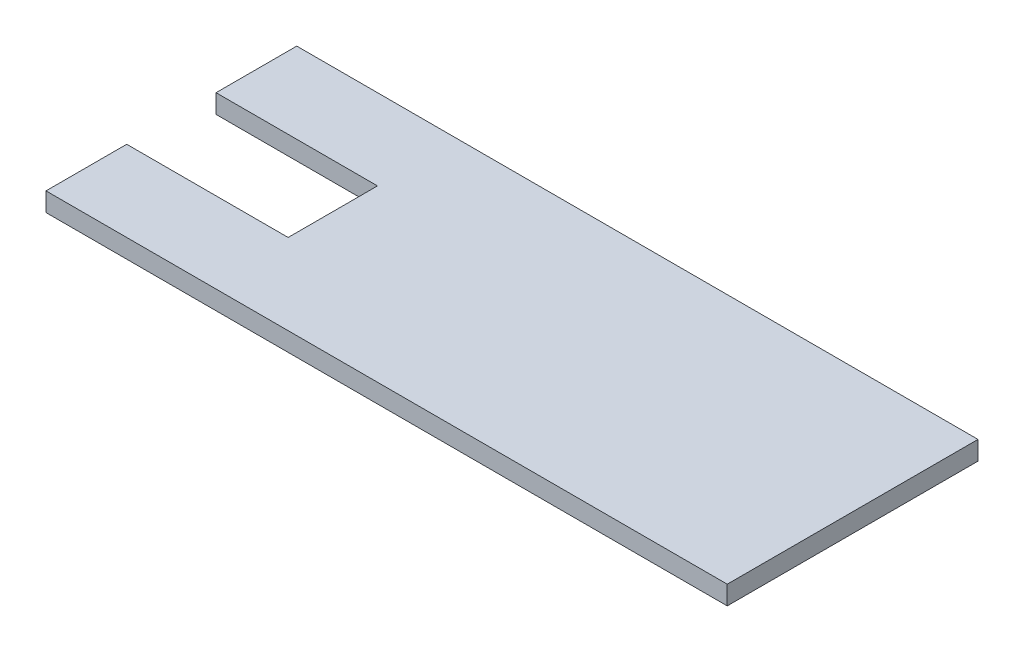
ISO-10303-21;
HEADER;
FILE_DESCRIPTION(('STEP AP214'),'2;1');
FILE_NAME('part.step','',(''),(''),'','','');
FILE_SCHEMA(('AUTOMOTIVE_DESIGN { 1 0 10303 214 1 1 1 1 }'));
ENDSEC;
DATA;
#1=APPLICATION_CONTEXT('core data for automotive mechanical design processes');
#2=APPLICATION_PROTOCOL_DEFINITION('international standard','automotive_design',2000,#1);
#3=PRODUCT_CONTEXT('',#1,'mechanical');
#4=PRODUCT('Part','Part','',(#3));
#5=PRODUCT_RELATED_PRODUCT_CATEGORY('part','',(#4));
#6=PRODUCT_DEFINITION_FORMATION('','',#4);
#7=PRODUCT_DEFINITION_CONTEXT('part definition',#1,'design');
#8=PRODUCT_DEFINITION('design','',#6,#7);
#9=PRODUCT_DEFINITION_SHAPE('','',#8);
#10=(LENGTH_UNIT() NAMED_UNIT(*) SI_UNIT(.MILLI.,.METRE.));
#11=(NAMED_UNIT(*) PLANE_ANGLE_UNIT() SI_UNIT($,.RADIAN.));
#12=(NAMED_UNIT(*) SI_UNIT($,.STERADIAN.) SOLID_ANGLE_UNIT());
#13=UNCERTAINTY_MEASURE_WITH_UNIT(LENGTH_MEASURE(1.E-05),#10,'distance_accuracy_value','');
#14=(GEOMETRIC_REPRESENTATION_CONTEXT(3) GLOBAL_UNCERTAINTY_ASSIGNED_CONTEXT((#13)) GLOBAL_UNIT_ASSIGNED_CONTEXT((#10,
#11,#12)) REPRESENTATION_CONTEXT('',''));
#15=CARTESIAN_POINT('',(0.,0.,0.));
#16=DIRECTION('',(0.,0.,1.));
#17=DIRECTION('',(1.,0.,0.));
#18=AXIS2_PLACEMENT_3D('',#15,#16,#17);
#19=CARTESIAN_POINT('',(-63.3,3.5,-23.3));
#20=DIRECTION('',(1.,0.,0.));
#21=DIRECTION('',(0.,0.,-1.));
#22=AXIS2_PLACEMENT_3D('',#19,#20,#21);
#23=PLANE('',#22);
#24=DIRECTION('',(0.,0.,1.));
#25=VECTOR('',#24,1.);
#26=CARTESIAN_POINT('',(-63.3,0.,-23.3));
#27=LINE('',#26,#25);
#28=CARTESIAN_POINT('',(-63.3,0.,-23.3));
#29=VERTEX_POINT('',#28);
#30=CARTESIAN_POINT('',(-63.3,0.,-8.29999999999999));
#31=VERTEX_POINT('',#30);
#32=EDGE_CURVE('E126',#29,#31,#27,.T.);
#33=ORIENTED_EDGE('',*,*,#32,.T.);
#34=DIRECTION('',(0.,1.,0.));
#35=VECTOR('',#34,1.);
#36=CARTESIAN_POINT('',(-63.3,0.,-8.29999999999999));
#37=LINE('',#36,#35);
#38=CARTESIAN_POINT('',(-63.3,3.5,-8.29999999999999));
#39=VERTEX_POINT('',#38);
#40=EDGE_CURVE('E127',#31,#39,#37,.T.);
#41=ORIENTED_EDGE('',*,*,#40,.T.);
#42=DIRECTION('',(0.,0.,1.));
#43=VECTOR('',#42,1.);
#44=CARTESIAN_POINT('',(-63.3,3.5,-23.3));
#45=LINE('',#44,#43);
#46=CARTESIAN_POINT('',(-63.3,3.5,-23.3));
#47=VERTEX_POINT('',#46);
#48=EDGE_CURVE('E156',#47,#39,#45,.T.);
#49=ORIENTED_EDGE('',*,*,#48,.F.);
#50=DIRECTION('',(0.,-1.,0.));
#51=VECTOR('',#50,1.);
#52=CARTESIAN_POINT('',(-63.3,3.5,-23.3));
#53=LINE('',#52,#51);
#54=EDGE_CURVE('E140',#47,#29,#53,.T.);
#55=ORIENTED_EDGE('',*,*,#54,.T.);
#56=EDGE_LOOP('',(#33,#41,#49,#55));
#57=FACE_BOUND('',#56,.T.);
#58=ADVANCED_FACE('F33',(#57),#23,.F.);
#59=CARTESIAN_POINT('',(-63.3,3.5,8.3));
#60=VERTEX_POINT('',#59);
#61=CARTESIAN_POINT('',(-63.3,3.5,23.3));
#62=VERTEX_POINT('',#61);
#63=EDGE_CURVE('E85',#60,#62,#45,.T.);
#64=ORIENTED_EDGE('',*,*,#63,.F.);
#65=DIRECTION('',(0.,1.,0.));
#66=VECTOR('',#65,1.);
#67=CARTESIAN_POINT('',(-63.3,0.,8.3));
#68=LINE('',#67,#66);
#69=CARTESIAN_POINT('',(-63.3,0.,8.3));
#70=VERTEX_POINT('',#69);
#71=EDGE_CURVE('E111',#70,#60,#68,.T.);
#72=ORIENTED_EDGE('',*,*,#71,.F.);
#73=CARTESIAN_POINT('',(-63.3,0.,23.3));
#74=VERTEX_POINT('',#73);
#75=EDGE_CURVE('E119',#70,#74,#27,.T.);
#76=ORIENTED_EDGE('',*,*,#75,.T.);
#77=DIRECTION('',(0.,-1.,0.));
#78=VECTOR('',#77,1.);
#79=CARTESIAN_POINT('',(-63.3,3.5,23.3));
#80=LINE('',#79,#78);
#81=EDGE_CURVE('E11',#62,#74,#80,.T.);
#82=ORIENTED_EDGE('',*,*,#81,.F.);
#83=EDGE_LOOP('',(#64,#72,#76,#82));
#84=FACE_BOUND('',#83,.T.);
#85=ADVANCED_FACE('F35',(#84),#23,.F.);
#86=CARTESIAN_POINT('',(-63.3,3.5,23.3));
#87=DIRECTION('',(0.,0.,-1.));
#88=DIRECTION('',(-1.,0.,0.));
#89=AXIS2_PLACEMENT_3D('',#86,#87,#88);
#90=PLANE('',#89);
#91=DIRECTION('',(1.,0.,0.));
#92=VECTOR('',#91,1.);
#93=CARTESIAN_POINT('',(-63.3,0.,23.3));
#94=LINE('',#93,#92);
#95=CARTESIAN_POINT('',(63.3,0.,23.3));
#96=VERTEX_POINT('',#95);
#97=EDGE_CURVE('E125',#74,#96,#94,.T.);
#98=ORIENTED_EDGE('',*,*,#97,.T.);
#99=DIRECTION('',(0.,-1.,0.));
#100=VECTOR('',#99,1.);
#101=CARTESIAN_POINT('',(63.3,3.5,23.3));
#102=LINE('',#101,#100);
#103=CARTESIAN_POINT('',(63.3,3.5,23.3));
#104=VERTEX_POINT('',#103);
#105=EDGE_CURVE('E41',#104,#96,#102,.T.);
#106=ORIENTED_EDGE('',*,*,#105,.F.);
#107=DIRECTION('',(1.,0.,0.));
#108=VECTOR('',#107,1.);
#109=CARTESIAN_POINT('',(-63.3,3.5,23.3));
#110=LINE('',#109,#108);
#111=EDGE_CURVE('E158',#62,#104,#110,.T.);
#112=ORIENTED_EDGE('',*,*,#111,.F.);
#113=ORIENTED_EDGE('',*,*,#81,.T.);
#114=EDGE_LOOP('',(#98,#106,#112,#113));
#115=FACE_BOUND('',#114,.T.);
#116=ADVANCED_FACE('F189',(#115),#90,.F.);
#117=CARTESIAN_POINT('',(63.3,3.5,-23.3));
#118=DIRECTION('',(-1.,0.,0.));
#119=DIRECTION('',(0.,0.,1.));
#120=AXIS2_PLACEMENT_3D('',#117,#118,#119);
#121=PLANE('',#120);
#122=DIRECTION('',(0.,0.,-1.));
#123=VECTOR('',#122,1.);
#124=CARTESIAN_POINT('',(63.3,0.,-23.3));
#125=LINE('',#124,#123);
#126=CARTESIAN_POINT('',(63.3,0.,-23.3));
#127=VERTEX_POINT('',#126);
#128=EDGE_CURVE('E137',#96,#127,#125,.T.);
#129=ORIENTED_EDGE('',*,*,#128,.T.);
#130=DIRECTION('',(0.,-1.,0.));
#131=VECTOR('',#130,1.);
#132=CARTESIAN_POINT('',(63.3,3.5,-23.3));
#133=LINE('',#132,#131);
#134=CARTESIAN_POINT('',(63.3,3.5,-23.3));
#135=VERTEX_POINT('',#134);
#136=EDGE_CURVE('E142',#135,#127,#133,.T.);
#137=ORIENTED_EDGE('',*,*,#136,.F.);
#138=DIRECTION('',(0.,0.,-1.));
#139=VECTOR('',#138,1.);
#140=CARTESIAN_POINT('',(63.3,3.5,-23.3));
#141=LINE('',#140,#139);
#142=EDGE_CURVE('E149',#104,#135,#141,.T.);
#143=ORIENTED_EDGE('',*,*,#142,.F.);
#144=ORIENTED_EDGE('',*,*,#105,.T.);
#145=EDGE_LOOP('',(#129,#137,#143,#144));
#146=FACE_BOUND('',#145,.T.);
#147=ADVANCED_FACE('F147',(#146),#121,.F.);
#148=CARTESIAN_POINT('',(-63.3,3.5,-23.3));
#149=DIRECTION('',(0.,0.,1.));
#150=DIRECTION('',(1.,0.,0.));
#151=AXIS2_PLACEMENT_3D('',#148,#149,#150);
#152=PLANE('',#151);
#153=DIRECTION('',(-1.,0.,0.));
#154=VECTOR('',#153,1.);
#155=CARTESIAN_POINT('',(-63.3,0.,-23.3));
#156=LINE('',#155,#154);
#157=EDGE_CURVE('E78',#127,#29,#156,.T.);
#158=ORIENTED_EDGE('',*,*,#157,.T.);
#159=ORIENTED_EDGE('',*,*,#54,.F.);
#160=DIRECTION('',(-1.,0.,0.));
#161=VECTOR('',#160,1.);
#162=CARTESIAN_POINT('',(-63.3,3.5,-23.3));
#163=LINE('',#162,#161);
#164=EDGE_CURVE('E57',#135,#47,#163,.T.);
#165=ORIENTED_EDGE('',*,*,#164,.F.);
#166=ORIENTED_EDGE('',*,*,#136,.T.);
#167=EDGE_LOOP('',(#158,#159,#165,#166));
#168=FACE_BOUND('',#167,.T.);
#169=ADVANCED_FACE('F157',(#168),#152,.F.);
#170=CARTESIAN_POINT('',(0.,3.5,0.));
#171=DIRECTION('',(0.,1.,0.));
#172=DIRECTION('',(0.,0.,1.));
#173=AXIS2_PLACEMENT_3D('',#170,#171,#172);
#174=PLANE('',#173);
#175=DIRECTION('',(-1.,0.,0.));
#176=VECTOR('',#175,1.);
#177=CARTESIAN_POINT('',(-63.3,3.5,-8.29999999999999));
#178=LINE('',#177,#176);
#179=CARTESIAN_POINT('',(-33.3,3.5,-8.29999999999999));
#180=VERTEX_POINT('',#179);
#181=EDGE_CURVE('E115',#180,#39,#178,.T.);
#182=ORIENTED_EDGE('',*,*,#181,.F.);
#183=DIRECTION('',(0.,0.,-1.));
#184=VECTOR('',#183,1.);
#185=CARTESIAN_POINT('',(-33.3,3.5,-8.29999999999999));
#186=LINE('',#185,#184);
#187=CARTESIAN_POINT('',(-33.3,3.5,8.3));
#188=VERTEX_POINT('',#187);
#189=EDGE_CURVE('E165',#188,#180,#186,.T.);
#190=ORIENTED_EDGE('',*,*,#189,.F.);
#191=DIRECTION('',(1.,0.,0.));
#192=VECTOR('',#191,1.);
#193=CARTESIAN_POINT('',(-63.3,3.5,8.3));
#194=LINE('',#193,#192);
#195=EDGE_CURVE('E168',#60,#188,#194,.T.);
#196=ORIENTED_EDGE('',*,*,#195,.F.);
#197=ORIENTED_EDGE('',*,*,#63,.T.);
#198=ORIENTED_EDGE('',*,*,#111,.T.);
#199=ORIENTED_EDGE('',*,*,#142,.T.);
#200=ORIENTED_EDGE('',*,*,#164,.T.);
#201=ORIENTED_EDGE('',*,*,#48,.T.);
#202=EDGE_LOOP('',(#182,#190,#196,#197,#198,#199,#200,#201));
#203=FACE_BOUND('',#202,.T.);
#204=ADVANCED_FACE('F173',(#203),#174,.T.);
#205=CARTESIAN_POINT('',(0.,0.,0.));
#206=DIRECTION('',(0.,1.,0.));
#207=DIRECTION('',(0.,0.,1.));
#208=AXIS2_PLACEMENT_3D('',#205,#206,#207);
#209=PLANE('',#208);
#210=DIRECTION('',(0.,0.,-1.));
#211=VECTOR('',#210,1.);
#212=CARTESIAN_POINT('',(-33.3,0.,-8.29999999999999));
#213=LINE('',#212,#211);
#214=CARTESIAN_POINT('',(-33.3,0.,8.3));
#215=VERTEX_POINT('',#214);
#216=CARTESIAN_POINT('',(-33.3,0.,-8.29999999999999));
#217=VERTEX_POINT('',#216);
#218=EDGE_CURVE('E48',#215,#217,#213,.T.);
#219=ORIENTED_EDGE('',*,*,#218,.T.);
#220=DIRECTION('',(-1.,0.,0.));
#221=VECTOR('',#220,1.);
#222=CARTESIAN_POINT('',(-63.3,0.,-8.29999999999999));
#223=LINE('',#222,#221);
#224=EDGE_CURVE('E121',#217,#31,#223,.T.);
#225=ORIENTED_EDGE('',*,*,#224,.T.);
#226=ORIENTED_EDGE('',*,*,#32,.F.);
#227=ORIENTED_EDGE('',*,*,#157,.F.);
#228=ORIENTED_EDGE('',*,*,#128,.F.);
#229=ORIENTED_EDGE('',*,*,#97,.F.);
#230=ORIENTED_EDGE('',*,*,#75,.F.);
#231=DIRECTION('',(1.,0.,0.));
#232=VECTOR('',#231,1.);
#233=CARTESIAN_POINT('',(-63.3,0.,8.3));
#234=LINE('',#233,#232);
#235=EDGE_CURVE('E107',#70,#215,#234,.T.);
#236=ORIENTED_EDGE('',*,*,#235,.T.);
#237=EDGE_LOOP('',(#219,#225,#226,#227,#228,#229,#230,#236));
#238=FACE_BOUND('',#237,.T.);
#239=ADVANCED_FACE('F123',(#238),#209,.F.);
#240=CARTESIAN_POINT('',(-63.3,0.,-8.29999999999999));
#241=DIRECTION('',(0.,0.,-1.));
#242=DIRECTION('',(-1.,0.,0.));
#243=AXIS2_PLACEMENT_3D('',#240,#241,#242);
#244=PLANE('',#243);
#245=ORIENTED_EDGE('',*,*,#181,.T.);
#246=ORIENTED_EDGE('',*,*,#40,.F.);
#247=ORIENTED_EDGE('',*,*,#224,.F.);
#248=DIRECTION('',(0.,1.,0.));
#249=VECTOR('',#248,1.);
#250=CARTESIAN_POINT('',(-33.3,0.,-8.29999999999999));
#251=LINE('',#250,#249);
#252=EDGE_CURVE('E131',#217,#180,#251,.T.);
#253=ORIENTED_EDGE('',*,*,#252,.T.);
#254=EDGE_LOOP('',(#245,#246,#247,#253));
#255=FACE_BOUND('',#254,.T.);
#256=ADVANCED_FACE('F176',(#255),#244,.F.);
#257=CARTESIAN_POINT('',(-33.3,0.,-8.29999999999999));
#258=DIRECTION('',(1.,0.,0.));
#259=DIRECTION('',(0.,0.,-1.));
#260=AXIS2_PLACEMENT_3D('',#257,#258,#259);
#261=PLANE('',#260);
#262=ORIENTED_EDGE('',*,*,#189,.T.);
#263=ORIENTED_EDGE('',*,*,#252,.F.);
#264=ORIENTED_EDGE('',*,*,#218,.F.);
#265=DIRECTION('',(0.,1.,0.));
#266=VECTOR('',#265,1.);
#267=CARTESIAN_POINT('',(-33.3,0.,8.3));
#268=LINE('',#267,#266);
#269=EDGE_CURVE('E112',#215,#188,#268,.T.);
#270=ORIENTED_EDGE('',*,*,#269,.T.);
#271=EDGE_LOOP('',(#262,#263,#264,#270));
#272=FACE_BOUND('',#271,.T.);
#273=ADVANCED_FACE('F174',(#272),#261,.F.);
#274=CARTESIAN_POINT('',(-63.3,0.,8.3));
#275=DIRECTION('',(0.,0.,1.));
#276=DIRECTION('',(1.,0.,0.));
#277=AXIS2_PLACEMENT_3D('',#274,#275,#276);
#278=PLANE('',#277);
#279=ORIENTED_EDGE('',*,*,#195,.T.);
#280=ORIENTED_EDGE('',*,*,#269,.F.);
#281=ORIENTED_EDGE('',*,*,#235,.F.);
#282=ORIENTED_EDGE('',*,*,#71,.T.);
#283=EDGE_LOOP('',(#279,#280,#281,#282));
#284=FACE_BOUND('',#283,.T.);
#285=ADVANCED_FACE('F110',(#284),#278,.F.);
#286=CLOSED_SHELL('',(#58,#85,#116,#147,#169,#204,#239,#256,#273,#285));
#287=MANIFOLD_SOLID_BREP('B2',#286);
#288=ADVANCED_BREP_SHAPE_REPRESENTATION('',(#18,#287),#14);
#289=SHAPE_DEFINITION_REPRESENTATION(#9,#288);
ENDSEC;
END-ISO-10303-21;
